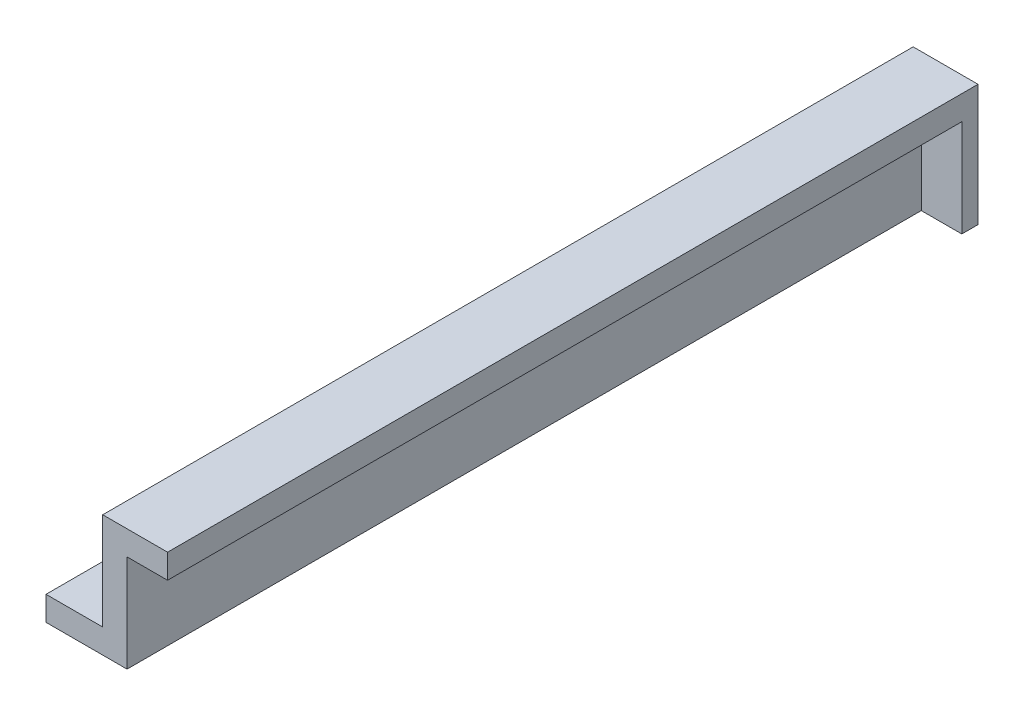
ISO-10303-21;
HEADER;
FILE_DESCRIPTION(('STEP AP214'),'2;1');
FILE_NAME('part.step','',(''),(''),'','','');
FILE_SCHEMA(('AUTOMOTIVE_DESIGN { 1 0 10303 214 1 1 1 1 }'));
ENDSEC;
DATA;
#1=APPLICATION_CONTEXT('core data for automotive mechanical design processes');
#2=APPLICATION_PROTOCOL_DEFINITION('international standard','automotive_design',2000,#1);
#3=PRODUCT_CONTEXT('',#1,'mechanical');
#4=PRODUCT('Part','Part','',(#3));
#5=PRODUCT_RELATED_PRODUCT_CATEGORY('part','',(#4));
#6=PRODUCT_DEFINITION_FORMATION('','',#4);
#7=PRODUCT_DEFINITION_CONTEXT('part definition',#1,'design');
#8=PRODUCT_DEFINITION('design','',#6,#7);
#9=PRODUCT_DEFINITION_SHAPE('','',#8);
#10=(LENGTH_UNIT() NAMED_UNIT(*) SI_UNIT(.MILLI.,.METRE.));
#11=(NAMED_UNIT(*) PLANE_ANGLE_UNIT() SI_UNIT($,.RADIAN.));
#12=(NAMED_UNIT(*) SI_UNIT($,.STERADIAN.) SOLID_ANGLE_UNIT());
#13=UNCERTAINTY_MEASURE_WITH_UNIT(LENGTH_MEASURE(1.E-05),#10,'distance_accuracy_value','');
#14=(GEOMETRIC_REPRESENTATION_CONTEXT(3) GLOBAL_UNCERTAINTY_ASSIGNED_CONTEXT((#13)) GLOBAL_UNIT_ASSIGNED_CONTEXT((#10,
#11,#12)) REPRESENTATION_CONTEXT('',''));
#15=CARTESIAN_POINT('',(0.,0.,0.));
#16=DIRECTION('',(0.,0.,1.));
#17=DIRECTION('',(1.,0.,0.));
#18=AXIS2_PLACEMENT_3D('',#15,#16,#17);
#19=CARTESIAN_POINT('',(0.,0.,100.));
#20=DIRECTION('',(1.,0.,0.));
#21=DIRECTION('',(0.,0.,-1.));
#22=AXIS2_PLACEMENT_3D('',#19,#20,#21);
#23=PLANE('',#22);
#24=DIRECTION('',(0.,-1.,0.));
#25=VECTOR('',#24,1.);
#26=CARTESIAN_POINT('',(0.,0.,0.));
#27=LINE('',#26,#25);
#28=CARTESIAN_POINT('',(0.,0.,0.));
#29=VERTEX_POINT('',#28);
#30=CARTESIAN_POINT('',(0.,-3.,0.));
#31=VERTEX_POINT('',#30);
#32=EDGE_CURVE('E143',#29,#31,#27,.T.);
#33=ORIENTED_EDGE('',*,*,#32,.T.);
#34=DIRECTION('',(0.,0.,-1.));
#35=VECTOR('',#34,1.);
#36=CARTESIAN_POINT('',(0.,-3.,100.));
#37=LINE('',#36,#35);
#38=CARTESIAN_POINT('',(0.,-3.,100.));
#39=VERTEX_POINT('',#38);
#40=EDGE_CURVE('E11',#39,#31,#37,.T.);
#41=ORIENTED_EDGE('',*,*,#40,.F.);
#42=DIRECTION('',(0.,-1.,0.));
#43=VECTOR('',#42,1.);
#44=CARTESIAN_POINT('',(0.,0.,100.));
#45=LINE('',#44,#43);
#46=CARTESIAN_POINT('',(0.,0.,100.));
#47=VERTEX_POINT('',#46);
#48=EDGE_CURVE('E144',#47,#39,#45,.T.);
#49=ORIENTED_EDGE('',*,*,#48,.F.);
#50=DIRECTION('',(0.,0.,-1.));
#51=VECTOR('',#50,1.);
#52=CARTESIAN_POINT('',(0.,0.,100.));
#53=LINE('',#52,#51);
#54=EDGE_CURVE('E162',#47,#29,#53,.T.);
#55=ORIENTED_EDGE('',*,*,#54,.T.);
#56=EDGE_LOOP('',(#33,#41,#49,#55));
#57=FACE_BOUND('',#56,.T.);
#58=ADVANCED_FACE('F32',(#57),#23,.F.);
#59=CARTESIAN_POINT('',(0.,-3.,100.));
#60=DIRECTION('',(0.,1.,0.));
#61=DIRECTION('',(0.,0.,1.));
#62=AXIS2_PLACEMENT_3D('',#59,#60,#61);
#63=PLANE('',#62);
#64=CARTESIAN_POINT('',(3.5,-3.,90.));
#65=DIRECTION('',(0.,1.,0.));
#66=DIRECTION('',(0.,0.,1.));
#67=AXIS2_PLACEMENT_3D('',#64,#65,#66);
#68=CIRCLE('',#67,2.00000000000001);
#69=CARTESIAN_POINT('',(3.5,-3.,92.));
#70=VERTEX_POINT('',#69);
#71=EDGE_CURVE('E134',#70,#70,#68,.T.);
#72=ORIENTED_EDGE('',*,*,#71,.T.);
#73=EDGE_LOOP('',(#72));
#74=FACE_BOUND('',#73,.T.);
#75=CARTESIAN_POINT('',(3.49999999999999,-3.,50.));
#76=DIRECTION('',(0.,1.,0.));
#77=DIRECTION('',(0.,0.,1.));
#78=AXIS2_PLACEMENT_3D('',#75,#76,#77);
#79=CIRCLE('',#78,2.);
#80=CARTESIAN_POINT('',(3.49999999999999,-3.,52.));
#81=VERTEX_POINT('',#80);
#82=EDGE_CURVE('E129',#81,#81,#79,.T.);
#83=ORIENTED_EDGE('',*,*,#82,.T.);
#84=EDGE_LOOP('',(#83));
#85=FACE_BOUND('',#84,.T.);
#86=CARTESIAN_POINT('',(3.49999999999999,-3.,10.));
#87=DIRECTION('',(0.,1.,0.));
#88=DIRECTION('',(0.,0.,1.));
#89=AXIS2_PLACEMENT_3D('',#86,#87,#88);
#90=CIRCLE('',#89,2.);
#91=CARTESIAN_POINT('',(3.49999999999999,-3.,12.));
#92=VERTEX_POINT('',#91);
#93=EDGE_CURVE('E140',#92,#92,#90,.T.);
#94=ORIENTED_EDGE('',*,*,#93,.T.);
#95=EDGE_LOOP('',(#94));
#96=FACE_BOUND('',#95,.T.);
#97=DIRECTION('',(1.,0.,0.));
#98=VECTOR('',#97,1.);
#99=CARTESIAN_POINT('',(0.,-3.,0.));
#100=LINE('',#99,#98);
#101=CARTESIAN_POINT('',(15.,-3.,0.));
#102=VERTEX_POINT('',#101);
#103=EDGE_CURVE('E106',#31,#102,#100,.T.);
#104=ORIENTED_EDGE('',*,*,#103,.T.);
#105=DIRECTION('',(0.,0.,-1.));
#106=VECTOR('',#105,1.);
#107=CARTESIAN_POINT('',(15.,-3.,2.));
#108=LINE('',#107,#106);
#109=CARTESIAN_POINT('',(15.,-3.,2.));
#110=VERTEX_POINT('',#109);
#111=EDGE_CURVE('E101',#110,#102,#108,.T.);
#112=ORIENTED_EDGE('',*,*,#111,.F.);
#113=DIRECTION('',(-1.,0.,0.));
#114=VECTOR('',#113,1.);
#115=CARTESIAN_POINT('',(10.,-3.,2.));
#116=LINE('',#115,#114);
#117=CARTESIAN_POINT('',(10.,-3.,2.));
#118=VERTEX_POINT('',#117);
#119=EDGE_CURVE('E105',#110,#118,#116,.T.);
#120=ORIENTED_EDGE('',*,*,#119,.T.);
#121=DIRECTION('',(0.,0.,-1.));
#122=VECTOR('',#121,1.);
#123=CARTESIAN_POINT('',(10.,-3.,100.));
#124=LINE('',#123,#122);
#125=CARTESIAN_POINT('',(10.,-3.,100.));
#126=VERTEX_POINT('',#125);
#127=EDGE_CURVE('E39',#126,#118,#124,.T.);
#128=ORIENTED_EDGE('',*,*,#127,.F.);
#129=DIRECTION('',(1.,0.,0.));
#130=VECTOR('',#129,1.);
#131=CARTESIAN_POINT('',(0.,-3.,100.));
#132=LINE('',#131,#130);
#133=EDGE_CURVE('E147',#39,#126,#132,.T.);
#134=ORIENTED_EDGE('',*,*,#133,.F.);
#135=ORIENTED_EDGE('',*,*,#40,.T.);
#136=EDGE_LOOP('',(#104,#112,#120,#128,#134,#135));
#137=FACE_BOUND('',#136,.T.);
#138=ADVANCED_FACE('F103',(#74,#85,#96,#137),#63,.F.);
#139=CARTESIAN_POINT('',(10.,-3.,100.));
#140=DIRECTION('',(-1.,0.,0.));
#141=DIRECTION('',(0.,0.,1.));
#142=AXIS2_PLACEMENT_3D('',#139,#140,#141);
#143=PLANE('',#142);
#144=ORIENTED_EDGE('',*,*,#127,.T.);
#145=DIRECTION('',(0.,1.,0.));
#146=VECTOR('',#145,1.);
#147=CARTESIAN_POINT('',(10.,9.,2.));
#148=LINE('',#147,#146);
#149=CARTESIAN_POINT('',(10.,9.,2.));
#150=VERTEX_POINT('',#149);
#151=EDGE_CURVE('E49',#118,#150,#148,.T.);
#152=ORIENTED_EDGE('',*,*,#151,.T.);
#153=DIRECTION('',(0.,0.,-1.));
#154=VECTOR('',#153,1.);
#155=CARTESIAN_POINT('',(10.,9.,100.));
#156=LINE('',#155,#154);
#157=CARTESIAN_POINT('',(10.,9.,100.));
#158=VERTEX_POINT('',#157);
#159=EDGE_CURVE('E185',#158,#150,#156,.T.);
#160=ORIENTED_EDGE('',*,*,#159,.F.);
#161=DIRECTION('',(0.,1.,0.));
#162=VECTOR('',#161,1.);
#163=CARTESIAN_POINT('',(10.,-3.,100.));
#164=LINE('',#163,#162);
#165=EDGE_CURVE('E150',#126,#158,#164,.T.);
#166=ORIENTED_EDGE('',*,*,#165,.F.);
#167=EDGE_LOOP('',(#144,#152,#160,#166));
#168=FACE_BOUND('',#167,.T.);
#169=ADVANCED_FACE('F190',(#168),#143,.F.);
#170=CARTESIAN_POINT('',(10.,9.,100.));
#171=DIRECTION('',(0.,1.,0.));
#172=DIRECTION('',(0.,0.,1.));
#173=AXIS2_PLACEMENT_3D('',#170,#171,#172);
#174=PLANE('',#173);
#175=ORIENTED_EDGE('',*,*,#159,.T.);
#176=DIRECTION('',(1.,0.,0.));
#177=VECTOR('',#176,1.);
#178=CARTESIAN_POINT('',(10.,9.,2.));
#179=LINE('',#178,#177);
#180=CARTESIAN_POINT('',(15.,9.,2.));
#181=VERTEX_POINT('',#180);
#182=EDGE_CURVE('E120',#150,#181,#179,.T.);
#183=ORIENTED_EDGE('',*,*,#182,.T.);
#184=DIRECTION('',(0.,0.,-1.));
#185=VECTOR('',#184,1.);
#186=CARTESIAN_POINT('',(15.,9.,100.));
#187=LINE('',#186,#185);
#188=CARTESIAN_POINT('',(15.,9.,100.));
#189=VERTEX_POINT('',#188);
#190=EDGE_CURVE('E117',#189,#181,#187,.T.);
#191=ORIENTED_EDGE('',*,*,#190,.F.);
#192=DIRECTION('',(1.,0.,0.));
#193=VECTOR('',#192,1.);
#194=CARTESIAN_POINT('',(10.,9.,100.));
#195=LINE('',#194,#193);
#196=EDGE_CURVE('E152',#158,#189,#195,.T.);
#197=ORIENTED_EDGE('',*,*,#196,.F.);
#198=EDGE_LOOP('',(#175,#183,#191,#197));
#199=FACE_BOUND('',#198,.T.);
#200=ADVANCED_FACE('F188',(#199),#174,.F.);
#201=CARTESIAN_POINT('',(15.,12.,100.));
#202=DIRECTION('',(-1.,0.,0.));
#203=DIRECTION('',(0.,0.,1.));
#204=AXIS2_PLACEMENT_3D('',#201,#202,#203);
#205=PLANE('',#204);
#206=DIRECTION('',(0.,1.,0.));
#207=VECTOR('',#206,1.);
#208=CARTESIAN_POINT('',(15.,12.,0.));
#209=LINE('',#208,#207);
#210=CARTESIAN_POINT('',(15.,12.,0.));
#211=VERTEX_POINT('',#210);
#212=EDGE_CURVE('E166',#102,#211,#209,.T.);
#213=ORIENTED_EDGE('',*,*,#212,.T.);
#214=DIRECTION('',(0.,0.,-1.));
#215=VECTOR('',#214,1.);
#216=CARTESIAN_POINT('',(15.,12.,100.));
#217=LINE('',#216,#215);
#218=CARTESIAN_POINT('',(15.,12.,100.));
#219=VERTEX_POINT('',#218);
#220=EDGE_CURVE('E181',#219,#211,#217,.T.);
#221=ORIENTED_EDGE('',*,*,#220,.F.);
#222=DIRECTION('',(0.,1.,0.));
#223=VECTOR('',#222,1.);
#224=CARTESIAN_POINT('',(15.,12.,100.));
#225=LINE('',#224,#223);
#226=EDGE_CURVE('E154',#189,#219,#225,.T.);
#227=ORIENTED_EDGE('',*,*,#226,.F.);
#228=ORIENTED_EDGE('',*,*,#190,.T.);
#229=DIRECTION('',(0.,-1.,0.));
#230=VECTOR('',#229,1.);
#231=CARTESIAN_POINT('',(15.,9.,2.));
#232=LINE('',#231,#230);
#233=EDGE_CURVE('E113',#181,#110,#232,.T.);
#234=ORIENTED_EDGE('',*,*,#233,.T.);
#235=ORIENTED_EDGE('',*,*,#111,.T.);
#236=EDGE_LOOP('',(#213,#221,#227,#228,#234,#235));
#237=FACE_BOUND('',#236,.T.);
#238=ADVANCED_FACE('F114',(#237),#205,.F.);
#239=CARTESIAN_POINT('',(7.,12.,100.));
#240=DIRECTION('',(0.,-1.,0.));
#241=DIRECTION('',(0.,0.,-1.));
#242=AXIS2_PLACEMENT_3D('',#239,#240,#241);
#243=PLANE('',#242);
#244=DIRECTION('',(-1.,0.,0.));
#245=VECTOR('',#244,1.);
#246=CARTESIAN_POINT('',(7.,12.,0.));
#247=LINE('',#246,#245);
#248=CARTESIAN_POINT('',(7.,12.,0.));
#249=VERTEX_POINT('',#248);
#250=EDGE_CURVE('E168',#211,#249,#247,.T.);
#251=ORIENTED_EDGE('',*,*,#250,.T.);
#252=DIRECTION('',(0.,0.,-1.));
#253=VECTOR('',#252,1.);
#254=CARTESIAN_POINT('',(7.,12.,100.));
#255=LINE('',#254,#253);
#256=CARTESIAN_POINT('',(7.,12.,100.));
#257=VERTEX_POINT('',#256);
#258=EDGE_CURVE('E178',#257,#249,#255,.T.);
#259=ORIENTED_EDGE('',*,*,#258,.F.);
#260=DIRECTION('',(-1.,0.,0.));
#261=VECTOR('',#260,1.);
#262=CARTESIAN_POINT('',(7.,12.,100.));
#263=LINE('',#262,#261);
#264=EDGE_CURVE('E156',#219,#257,#263,.T.);
#265=ORIENTED_EDGE('',*,*,#264,.F.);
#266=ORIENTED_EDGE('',*,*,#220,.T.);
#267=EDGE_LOOP('',(#251,#259,#265,#266));
#268=FACE_BOUND('',#267,.T.);
#269=ADVANCED_FACE('F206',(#268),#243,.F.);
#270=CARTESIAN_POINT('',(7.,0.,100.));
#271=DIRECTION('',(1.,0.,0.));
#272=DIRECTION('',(0.,0.,-1.));
#273=AXIS2_PLACEMENT_3D('',#270,#271,#272);
#274=PLANE('',#273);
#275=DIRECTION('',(0.,-1.,0.));
#276=VECTOR('',#275,1.);
#277=CARTESIAN_POINT('',(7.,0.,0.));
#278=LINE('',#277,#276);
#279=CARTESIAN_POINT('',(7.,0.,0.));
#280=VERTEX_POINT('',#279);
#281=EDGE_CURVE('E170',#249,#280,#278,.T.);
#282=ORIENTED_EDGE('',*,*,#281,.T.);
#283=DIRECTION('',(0.,0.,-1.));
#284=VECTOR('',#283,1.);
#285=CARTESIAN_POINT('',(7.,0.,100.));
#286=LINE('',#285,#284);
#287=CARTESIAN_POINT('',(7.,0.,100.));
#288=VERTEX_POINT('',#287);
#289=EDGE_CURVE('E175',#288,#280,#286,.T.);
#290=ORIENTED_EDGE('',*,*,#289,.F.);
#291=DIRECTION('',(0.,-1.,0.));
#292=VECTOR('',#291,1.);
#293=CARTESIAN_POINT('',(7.,0.,100.));
#294=LINE('',#293,#292);
#295=EDGE_CURVE('E158',#257,#288,#294,.T.);
#296=ORIENTED_EDGE('',*,*,#295,.F.);
#297=ORIENTED_EDGE('',*,*,#258,.T.);
#298=EDGE_LOOP('',(#282,#290,#296,#297));
#299=FACE_BOUND('',#298,.T.);
#300=ADVANCED_FACE('F212',(#299),#274,.F.);
#301=CARTESIAN_POINT('',(0.,0.,100.));
#302=DIRECTION('',(0.,-1.,0.));
#303=DIRECTION('',(0.,0.,-1.));
#304=AXIS2_PLACEMENT_3D('',#301,#302,#303);
#305=PLANE('',#304);
#306=CARTESIAN_POINT('',(3.5,0.,90.));
#307=DIRECTION('',(0.,1.,0.));
#308=DIRECTION('',(0.,0.,1.));
#309=AXIS2_PLACEMENT_3D('',#306,#307,#308);
#310=CIRCLE('',#309,2.00000000000001);
#311=CARTESIAN_POINT('',(3.5,0.,92.));
#312=VERTEX_POINT('',#311);
#313=EDGE_CURVE('E126',#312,#312,#310,.T.);
#314=ORIENTED_EDGE('',*,*,#313,.F.);
#315=EDGE_LOOP('',(#314));
#316=FACE_BOUND('',#315,.T.);
#317=CARTESIAN_POINT('',(3.49999999999999,0.,50.));
#318=DIRECTION('',(0.,1.,0.));
#319=DIRECTION('',(0.,0.,1.));
#320=AXIS2_PLACEMENT_3D('',#317,#318,#319);
#321=CIRCLE('',#320,2.);
#322=CARTESIAN_POINT('',(3.49999999999999,0.,52.));
#323=VERTEX_POINT('',#322);
#324=EDGE_CURVE('E109',#323,#323,#321,.T.);
#325=ORIENTED_EDGE('',*,*,#324,.F.);
#326=EDGE_LOOP('',(#325));
#327=FACE_BOUND('',#326,.T.);
#328=CARTESIAN_POINT('',(3.49999999999999,0.,10.));
#329=DIRECTION('',(0.,1.,0.));
#330=DIRECTION('',(0.,0.,1.));
#331=AXIS2_PLACEMENT_3D('',#328,#329,#330);
#332=CIRCLE('',#331,2.);
#333=CARTESIAN_POINT('',(3.49999999999999,0.,12.));
#334=VERTEX_POINT('',#333);
#335=EDGE_CURVE('E137',#334,#334,#332,.T.);
#336=ORIENTED_EDGE('',*,*,#335,.F.);
#337=EDGE_LOOP('',(#336));
#338=FACE_BOUND('',#337,.T.);
#339=DIRECTION('',(-1.,0.,0.));
#340=VECTOR('',#339,1.);
#341=CARTESIAN_POINT('',(0.,0.,0.));
#342=LINE('',#341,#340);
#343=EDGE_CURVE('E148',#280,#29,#342,.T.);
#344=ORIENTED_EDGE('',*,*,#343,.T.);
#345=ORIENTED_EDGE('',*,*,#54,.F.);
#346=DIRECTION('',(-1.,0.,0.));
#347=VECTOR('',#346,1.);
#348=CARTESIAN_POINT('',(0.,0.,100.));
#349=LINE('',#348,#347);
#350=EDGE_CURVE('E160',#288,#47,#349,.T.);
#351=ORIENTED_EDGE('',*,*,#350,.F.);
#352=ORIENTED_EDGE('',*,*,#289,.T.);
#353=EDGE_LOOP('',(#344,#345,#351,#352));
#354=FACE_BOUND('',#353,.T.);
#355=ADVANCED_FACE('F214',(#316,#327,#338,#354),#305,.F.);
#356=CARTESIAN_POINT('',(0.,0.,100.));
#357=DIRECTION('',(0.,0.,1.));
#358=DIRECTION('',(1.,0.,0.));
#359=AXIS2_PLACEMENT_3D('',#356,#357,#358);
#360=PLANE('',#359);
#361=ORIENTED_EDGE('',*,*,#48,.T.);
#362=ORIENTED_EDGE('',*,*,#133,.T.);
#363=ORIENTED_EDGE('',*,*,#165,.T.);
#364=ORIENTED_EDGE('',*,*,#196,.T.);
#365=ORIENTED_EDGE('',*,*,#226,.T.);
#366=ORIENTED_EDGE('',*,*,#264,.T.);
#367=ORIENTED_EDGE('',*,*,#295,.T.);
#368=ORIENTED_EDGE('',*,*,#350,.T.);
#369=EDGE_LOOP('',(#361,#362,#363,#364,#365,#366,#367,#368));
#370=FACE_BOUND('',#369,.T.);
#371=ADVANCED_FACE('F192',(#370),#360,.T.);
#372=CARTESIAN_POINT('',(0.,0.,0.));
#373=DIRECTION('',(0.,0.,1.));
#374=DIRECTION('',(1.,0.,0.));
#375=AXIS2_PLACEMENT_3D('',#372,#373,#374);
#376=PLANE('',#375);
#377=ORIENTED_EDGE('',*,*,#32,.F.);
#378=ORIENTED_EDGE('',*,*,#343,.F.);
#379=ORIENTED_EDGE('',*,*,#281,.F.);
#380=ORIENTED_EDGE('',*,*,#250,.F.);
#381=ORIENTED_EDGE('',*,*,#212,.F.);
#382=ORIENTED_EDGE('',*,*,#103,.F.);
#383=EDGE_LOOP('',(#377,#378,#379,#380,#381,#382));
#384=FACE_BOUND('',#383,.T.);
#385=ADVANCED_FACE('F200',(#384),#376,.F.);
#386=CARTESIAN_POINT('',(3.49999999999999,-100.,10.));
#387=DIRECTION('',(0.,1.,0.));
#388=DIRECTION('',(0.,0.,1.));
#389=AXIS2_PLACEMENT_3D('',#386,#387,#388);
#390=CYLINDRICAL_SURFACE('',#389,2.);
#391=ORIENTED_EDGE('',*,*,#335,.T.);
#392=EDGE_LOOP('',(#391));
#393=FACE_BOUND('',#392,.T.);
#394=ORIENTED_EDGE('',*,*,#93,.F.);
#395=EDGE_LOOP('',(#394));
#396=FACE_BOUND('',#395,.T.);
#397=ADVANCED_FACE('F268',(#393,#396),#390,.F.);
#398=CARTESIAN_POINT('',(3.49999999999999,-100.,50.));
#399=DIRECTION('',(0.,1.,0.));
#400=DIRECTION('',(0.,0.,1.));
#401=AXIS2_PLACEMENT_3D('',#398,#399,#400);
#402=CYLINDRICAL_SURFACE('',#401,2.);
#403=ORIENTED_EDGE('',*,*,#324,.T.);
#404=EDGE_LOOP('',(#403));
#405=FACE_BOUND('',#404,.T.);
#406=ORIENTED_EDGE('',*,*,#82,.F.);
#407=EDGE_LOOP('',(#406));
#408=FACE_BOUND('',#407,.T.);
#409=ADVANCED_FACE('F273',(#405,#408),#402,.F.);
#410=CARTESIAN_POINT('',(3.5,-100.,90.));
#411=DIRECTION('',(0.,1.,0.));
#412=DIRECTION('',(0.,0.,1.));
#413=AXIS2_PLACEMENT_3D('',#410,#411,#412);
#414=CYLINDRICAL_SURFACE('',#413,2.00000000000001);
#415=ORIENTED_EDGE('',*,*,#313,.T.);
#416=EDGE_LOOP('',(#415));
#417=FACE_BOUND('',#416,.T.);
#418=ORIENTED_EDGE('',*,*,#71,.F.);
#419=EDGE_LOOP('',(#418));
#420=FACE_BOUND('',#419,.T.);
#421=ADVANCED_FACE('F283',(#417,#420),#414,.F.);
#422=CARTESIAN_POINT('',(0.,0.,2.));
#423=DIRECTION('',(0.,0.,1.));
#424=DIRECTION('',(1.,0.,0.));
#425=AXIS2_PLACEMENT_3D('',#422,#423,#424);
#426=PLANE('',#425);
#427=ORIENTED_EDGE('',*,*,#151,.F.);
#428=ORIENTED_EDGE('',*,*,#119,.F.);
#429=ORIENTED_EDGE('',*,*,#233,.F.);
#430=ORIENTED_EDGE('',*,*,#182,.F.);
#431=EDGE_LOOP('',(#427,#428,#429,#430));
#432=FACE_BOUND('',#431,.T.);
#433=ADVANCED_FACE('F122',(#432),#426,.T.);
#434=CLOSED_SHELL('',(#58,#138,#169,#200,#238,#269,#300,#355,#371,#385,#397,#409,#421,#433));
#435=MANIFOLD_SOLID_BREP('B2',#434);
#436=ADVANCED_BREP_SHAPE_REPRESENTATION('',(#18,#435),#14);
#437=SHAPE_DEFINITION_REPRESENTATION(#9,#436);
ENDSEC;
END-ISO-10303-21;
